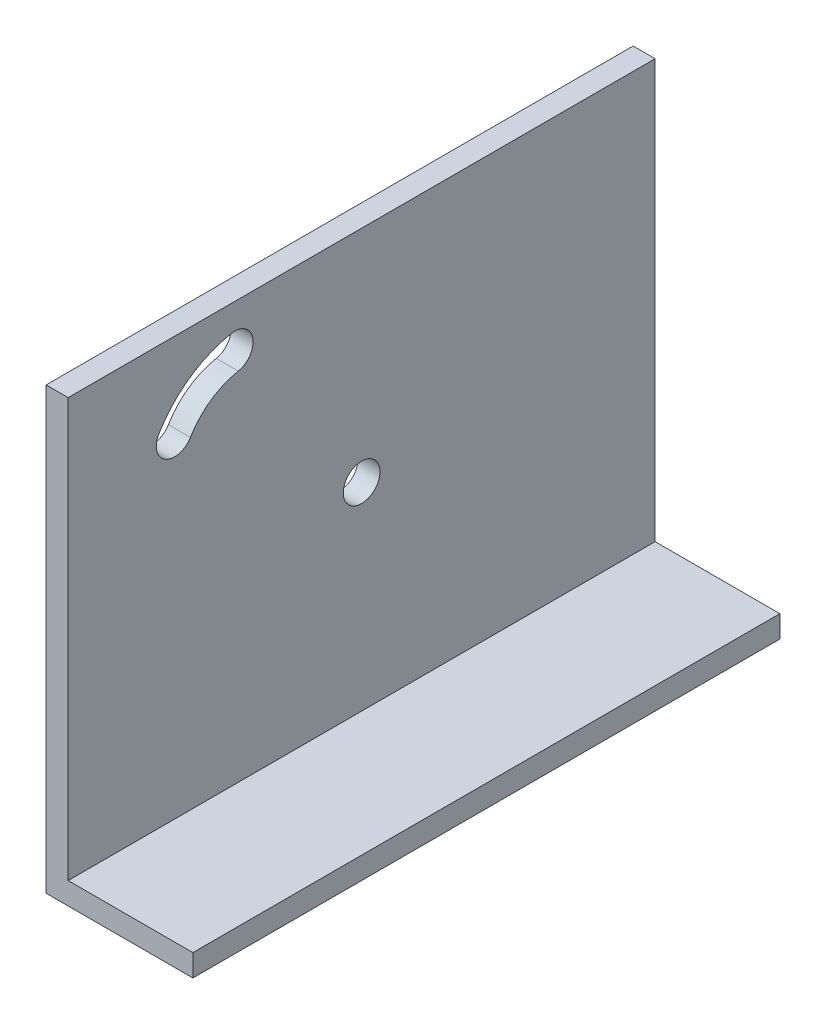
ISO-10303-21;
HEADER;
FILE_DESCRIPTION(('STEP AP214'),'2;1');
FILE_NAME('part.step','',(''),(''),'','','');
FILE_SCHEMA(('AUTOMOTIVE_DESIGN { 1 0 10303 214 1 1 1 1 }'));
ENDSEC;
DATA;
#1=APPLICATION_CONTEXT('core data for automotive mechanical design processes');
#2=APPLICATION_PROTOCOL_DEFINITION('international standard','automotive_design',2000,#1);
#3=PRODUCT_CONTEXT('',#1,'mechanical');
#4=PRODUCT('Part','Part','',(#3));
#5=PRODUCT_RELATED_PRODUCT_CATEGORY('part','',(#4));
#6=PRODUCT_DEFINITION_FORMATION('','',#4);
#7=PRODUCT_DEFINITION_CONTEXT('part definition',#1,'design');
#8=PRODUCT_DEFINITION('design','',#6,#7);
#9=PRODUCT_DEFINITION_SHAPE('','',#8);
#10=(LENGTH_UNIT() NAMED_UNIT(*) SI_UNIT(.MILLI.,.METRE.));
#11=(NAMED_UNIT(*) PLANE_ANGLE_UNIT() SI_UNIT($,.RADIAN.));
#12=(NAMED_UNIT(*) SI_UNIT($,.STERADIAN.) SOLID_ANGLE_UNIT());
#13=UNCERTAINTY_MEASURE_WITH_UNIT(LENGTH_MEASURE(1.E-05),#10,'distance_accuracy_value','');
#14=(GEOMETRIC_REPRESENTATION_CONTEXT(3) GLOBAL_UNCERTAINTY_ASSIGNED_CONTEXT((#13)) GLOBAL_UNIT_ASSIGNED_CONTEXT((#10,
#11,#12)) REPRESENTATION_CONTEXT('',''));
#15=CARTESIAN_POINT('',(0.,0.,0.));
#16=DIRECTION('',(0.,0.,1.));
#17=DIRECTION('',(1.,0.,0.));
#18=AXIS2_PLACEMENT_3D('',#15,#16,#17);
#19=CARTESIAN_POINT('',(0.,0.,80.));
#20=DIRECTION('',(1.,0.,0.));
#21=DIRECTION('',(0.,0.,-1.));
#22=AXIS2_PLACEMENT_3D('',#19,#20,#21);
#23=PLANE('',#22);
#24=CARTESIAN_POINT('',(0.,30.,40.));
#25=DIRECTION('',(-1.,0.,0.));
#26=DIRECTION('',(0.,0.,1.));
#27=AXIS2_PLACEMENT_3D('',#24,#25,#26);
#28=CIRCLE('',#27,2.5);
#29=CARTESIAN_POINT('',(0.,30.,42.5));
#30=VERTEX_POINT('',#29);
#31=EDGE_CURVE('E132',#30,#30,#28,.T.);
#32=ORIENTED_EDGE('',*,*,#31,.F.);
#33=EDGE_LOOP('',(#32));
#34=FACE_BOUND('',#33,.T.);
#35=DIRECTION('',(0.,-1.,0.));
#36=VECTOR('',#35,1.);
#37=CARTESIAN_POINT('',(0.,0.,0.));
#38=LINE('',#37,#36);
#39=CARTESIAN_POINT('',(0.,60.,0.));
#40=VERTEX_POINT('',#39);
#41=CARTESIAN_POINT('',(0.,0.,0.));
#42=VERTEX_POINT('',#41);
#43=EDGE_CURVE('E153',#40,#42,#38,.T.);
#44=ORIENTED_EDGE('',*,*,#43,.T.);
#45=DIRECTION('',(0.,0.,-1.));
#46=VECTOR('',#45,1.);
#47=CARTESIAN_POINT('',(0.,0.,80.));
#48=LINE('',#47,#46);
#49=CARTESIAN_POINT('',(0.,0.,80.));
#50=VERTEX_POINT('',#49);
#51=EDGE_CURVE('E179',#50,#42,#48,.T.);
#52=ORIENTED_EDGE('',*,*,#51,.F.);
#53=DIRECTION('',(0.,-1.,0.));
#54=VECTOR('',#53,1.);
#55=CARTESIAN_POINT('',(0.,0.,80.));
#56=LINE('',#55,#54);
#57=CARTESIAN_POINT('',(0.,60.,80.));
#58=VERTEX_POINT('',#57);
#59=EDGE_CURVE('E138',#58,#50,#56,.T.);
#60=ORIENTED_EDGE('',*,*,#59,.F.);
#61=DIRECTION('',(0.,0.,-1.));
#62=VECTOR('',#61,1.);
#63=CARTESIAN_POINT('',(0.,60.,80.));
#64=LINE('',#63,#62);
#65=EDGE_CURVE('E152',#58,#40,#64,.T.);
#66=ORIENTED_EDGE('',*,*,#65,.T.);
#67=EDGE_LOOP('',(#44,#52,#60,#66));
#68=FACE_BOUND('',#67,.T.);
#69=CARTESIAN_POINT('',(0.,42.,55.));
#70=DIRECTION('',(1.,0.,0.));
#71=DIRECTION('',(0.,0.,-1.));
#72=AXIS2_PLACEMENT_3D('',#69,#70,#71);
#73=CIRCLE('',#72,9.70655561573371);
#74=CARTESIAN_POINT('',(0.,51.5342666806233,56.8207088685695));
#75=VERTEX_POINT('',#74);
#76=CARTESIAN_POINT('',(0.,46.9741398812853,63.3351757247666));
#77=VERTEX_POINT('',#76);
#78=EDGE_CURVE('E120',#75,#77,#73,.T.);
#79=ORIENTED_EDGE('',*,*,#78,.F.);
#80=CARTESIAN_POINT('',(0.,53.9898923057341,57.289646806147));
#81=DIRECTION('',(-1.,0.,0.));
#82=DIRECTION('',(0.,0.,-1.));
#83=AXIS2_PLACEMENT_3D('',#80,#81,#82);
#84=CIRCLE('',#83,2.5);
#85=CARTESIAN_POINT('',(0.,56.4455179308448,57.7585847437245));
#86=VERTEX_POINT('',#85);
#87=EDGE_CURVE('E46',#86,#75,#84,.T.);
#88=ORIENTED_EDGE('',*,*,#87,.F.);
#89=CARTESIAN_POINT('',(0.,42.,55.));
#90=DIRECTION('',(-1.,0.,0.));
#91=DIRECTION('',(0.,0.,-1.));
#92=AXIS2_PLACEMENT_3D('',#89,#90,#91);
#93=CIRCLE('',#92,14.7065556157337);
#94=CARTESIAN_POINT('',(0.,49.5363978429162,67.6287562979082));
#95=VERTEX_POINT('',#94);
#96=EDGE_CURVE('E125',#95,#86,#93,.T.);
#97=ORIENTED_EDGE('',*,*,#96,.F.);
#98=CARTESIAN_POINT('',(0.,48.2552688621008,65.4819660113374));
#99=DIRECTION('',(-1.,0.,0.));
#100=DIRECTION('',(0.,0.,-1.));
#101=AXIS2_PLACEMENT_3D('',#98,#99,#100);
#102=CIRCLE('',#101,2.49999999999999);
#103=EDGE_CURVE('E111',#77,#95,#102,.T.);
#104=ORIENTED_EDGE('',*,*,#103,.F.);
#105=EDGE_LOOP('',(#79,#88,#97,#104));
#106=FACE_BOUND('',#105,.T.);
#107=ADVANCED_FACE('F32',(#34,#68,#106),#23,.F.);
#108=CARTESIAN_POINT('',(3.,60.,80.));
#109=DIRECTION('',(-1.,0.,0.));
#110=DIRECTION('',(0.,-1.,0.));
#111=AXIS2_PLACEMENT_3D('',#108,#109,#110);
#112=PLANE('',#111);
#113=CARTESIAN_POINT('',(3.,30.,40.));
#114=DIRECTION('',(-1.,0.,0.));
#115=DIRECTION('',(0.,-1.,0.));
#116=AXIS2_PLACEMENT_3D('',#113,#114,#115);
#117=CIRCLE('',#116,2.5);
#118=CARTESIAN_POINT('',(3.,27.5,40.));
#119=VERTEX_POINT('',#118);
#120=EDGE_CURVE('E137',#119,#119,#117,.T.);
#121=ORIENTED_EDGE('',*,*,#120,.T.);
#122=EDGE_LOOP('',(#121));
#123=FACE_BOUND('',#122,.T.);
#124=DIRECTION('',(0.,1.,0.));
#125=VECTOR('',#124,1.);
#126=CARTESIAN_POINT('',(3.,60.,0.));
#127=LINE('',#126,#125);
#128=CARTESIAN_POINT('',(3.00000000000001,3.,0.));
#129=VERTEX_POINT('',#128);
#130=CARTESIAN_POINT('',(3.,60.,0.));
#131=VERTEX_POINT('',#130);
#132=EDGE_CURVE('E162',#129,#131,#127,.T.);
#133=ORIENTED_EDGE('',*,*,#132,.T.);
#134=DIRECTION('',(0.,0.,-1.));
#135=VECTOR('',#134,1.);
#136=CARTESIAN_POINT('',(3.,60.,80.));
#137=LINE('',#136,#135);
#138=CARTESIAN_POINT('',(3.,60.,80.));
#139=VERTEX_POINT('',#138);
#140=EDGE_CURVE('E167',#139,#131,#137,.T.);
#141=ORIENTED_EDGE('',*,*,#140,.F.);
#142=DIRECTION('',(0.,1.,0.));
#143=VECTOR('',#142,1.);
#144=CARTESIAN_POINT('',(3.,60.,80.));
#145=LINE('',#144,#143);
#146=CARTESIAN_POINT('',(3.00000000000001,3.,80.));
#147=VERTEX_POINT('',#146);
#148=EDGE_CURVE('E148',#147,#139,#145,.T.);
#149=ORIENTED_EDGE('',*,*,#148,.F.);
#150=DIRECTION('',(0.,0.,-1.));
#151=VECTOR('',#150,1.);
#152=CARTESIAN_POINT('',(3.00000000000001,3.,80.));
#153=LINE('',#152,#151);
#154=EDGE_CURVE('E170',#147,#129,#153,.T.);
#155=ORIENTED_EDGE('',*,*,#154,.T.);
#156=EDGE_LOOP('',(#133,#141,#149,#155));
#157=FACE_BOUND('',#156,.T.);
#158=CARTESIAN_POINT('',(3.,42.,55.));
#159=DIRECTION('',(-1.,0.,0.));
#160=DIRECTION('',(0.,-1.,0.));
#161=AXIS2_PLACEMENT_3D('',#158,#159,#160);
#162=CIRCLE('',#161,14.7065556157337);
#163=CARTESIAN_POINT('',(3.,49.5363978429162,67.6287562979082));
#164=VERTEX_POINT('',#163);
#165=CARTESIAN_POINT('',(3.,56.4455179308448,57.7585847437245));
#166=VERTEX_POINT('',#165);
#167=EDGE_CURVE('E39',#164,#166,#162,.T.);
#168=ORIENTED_EDGE('',*,*,#167,.T.);
#169=CARTESIAN_POINT('',(3.,53.9898923057341,57.289646806147));
#170=DIRECTION('',(-1.,0.,0.));
#171=DIRECTION('',(0.,-1.,0.));
#172=AXIS2_PLACEMENT_3D('',#169,#170,#171);
#173=CIRCLE('',#172,2.5);
#174=CARTESIAN_POINT('',(3.,51.5342666806233,56.8207088685695));
#175=VERTEX_POINT('',#174);
#176=EDGE_CURVE('E11',#166,#175,#173,.T.);
#177=ORIENTED_EDGE('',*,*,#176,.T.);
#178=CARTESIAN_POINT('',(3.,42.,55.));
#179=DIRECTION('',(-1.,0.,0.));
#180=DIRECTION('',(0.,-1.,0.));
#181=AXIS2_PLACEMENT_3D('',#178,#179,#180);
#182=CIRCLE('',#181,9.70655561573371);
#183=CARTESIAN_POINT('',(3.,46.9741398812853,63.3351757247666));
#184=VERTEX_POINT('',#183);
#185=EDGE_CURVE('E182',#175,#184,#182,.F.);
#186=ORIENTED_EDGE('',*,*,#185,.T.);
#187=CARTESIAN_POINT('',(3.,48.2552688621008,65.4819660113374));
#188=DIRECTION('',(-1.,0.,0.));
#189=DIRECTION('',(0.,-1.,0.));
#190=AXIS2_PLACEMENT_3D('',#187,#188,#189);
#191=CIRCLE('',#190,2.49999999999999);
#192=EDGE_CURVE('E114',#184,#164,#191,.T.);
#193=ORIENTED_EDGE('',*,*,#192,.T.);
#194=EDGE_LOOP('',(#168,#177,#186,#193));
#195=FACE_BOUND('',#194,.T.);
#196=ADVANCED_FACE('F188',(#123,#157,#195),#112,.F.);
#197=CARTESIAN_POINT('',(0.,0.,80.));
#198=DIRECTION('',(0.,1.,0.));
#199=DIRECTION('',(0.,0.,1.));
#200=AXIS2_PLACEMENT_3D('',#197,#198,#199);
#201=PLANE('',#200);
#202=DIRECTION('',(1.,0.,0.));
#203=VECTOR('',#202,1.);
#204=CARTESIAN_POINT('',(0.,0.,0.));
#205=LINE('',#204,#203);
#206=CARTESIAN_POINT('',(20.,0.,0.));
#207=VERTEX_POINT('',#206);
#208=EDGE_CURVE('E156',#42,#207,#205,.T.);
#209=ORIENTED_EDGE('',*,*,#208,.T.);
#210=DIRECTION('',(0.,0.,-1.));
#211=VECTOR('',#210,1.);
#212=CARTESIAN_POINT('',(20.,0.,80.));
#213=LINE('',#212,#211);
#214=CARTESIAN_POINT('',(20.,0.,80.));
#215=VERTEX_POINT('',#214);
#216=EDGE_CURVE('E176',#215,#207,#213,.T.);
#217=ORIENTED_EDGE('',*,*,#216,.F.);
#218=DIRECTION('',(1.,0.,0.));
#219=VECTOR('',#218,1.);
#220=CARTESIAN_POINT('',(0.,0.,80.));
#221=LINE('',#220,#219);
#222=EDGE_CURVE('E141',#50,#215,#221,.T.);
#223=ORIENTED_EDGE('',*,*,#222,.F.);
#224=ORIENTED_EDGE('',*,*,#51,.T.);
#225=EDGE_LOOP('',(#209,#217,#223,#224));
#226=FACE_BOUND('',#225,.T.);
#227=ADVANCED_FACE('F210',(#226),#201,.F.);
#228=CARTESIAN_POINT('',(20.,0.,80.));
#229=DIRECTION('',(-1.,0.,0.));
#230=DIRECTION('',(0.,-1.,0.));
#231=AXIS2_PLACEMENT_3D('',#228,#229,#230);
#232=PLANE('',#231);
#233=DIRECTION('',(0.,1.,0.));
#234=VECTOR('',#233,1.);
#235=CARTESIAN_POINT('',(20.,0.,0.));
#236=LINE('',#235,#234);
#237=CARTESIAN_POINT('',(20.,3.,0.));
#238=VERTEX_POINT('',#237);
#239=EDGE_CURVE('E158',#207,#238,#236,.T.);
#240=ORIENTED_EDGE('',*,*,#239,.T.);
#241=DIRECTION('',(0.,0.,-1.));
#242=VECTOR('',#241,1.);
#243=CARTESIAN_POINT('',(20.,3.,80.));
#244=LINE('',#243,#242);
#245=CARTESIAN_POINT('',(20.,3.,80.));
#246=VERTEX_POINT('',#245);
#247=EDGE_CURVE('E173',#246,#238,#244,.T.);
#248=ORIENTED_EDGE('',*,*,#247,.F.);
#249=DIRECTION('',(0.,1.,0.));
#250=VECTOR('',#249,1.);
#251=CARTESIAN_POINT('',(20.,0.,80.));
#252=LINE('',#251,#250);
#253=EDGE_CURVE('E144',#215,#246,#252,.T.);
#254=ORIENTED_EDGE('',*,*,#253,.F.);
#255=ORIENTED_EDGE('',*,*,#216,.T.);
#256=EDGE_LOOP('',(#240,#248,#254,#255));
#257=FACE_BOUND('',#256,.T.);
#258=ADVANCED_FACE('F241',(#257),#232,.F.);
#259=CARTESIAN_POINT('',(20.,3.,80.));
#260=DIRECTION('',(0.,-1.,0.));
#261=DIRECTION('',(1.,0.,0.));
#262=AXIS2_PLACEMENT_3D('',#259,#260,#261);
#263=PLANE('',#262);
#264=DIRECTION('',(-1.,0.,0.));
#265=VECTOR('',#264,1.);
#266=CARTESIAN_POINT('',(20.,3.,0.));
#267=LINE('',#266,#265);
#268=EDGE_CURVE('E160',#238,#129,#267,.T.);
#269=ORIENTED_EDGE('',*,*,#268,.T.);
#270=ORIENTED_EDGE('',*,*,#154,.F.);
#271=DIRECTION('',(-1.,0.,0.));
#272=VECTOR('',#271,1.);
#273=CARTESIAN_POINT('',(20.,3.,80.));
#274=LINE('',#273,#272);
#275=EDGE_CURVE('E146',#246,#147,#274,.T.);
#276=ORIENTED_EDGE('',*,*,#275,.F.);
#277=ORIENTED_EDGE('',*,*,#247,.T.);
#278=EDGE_LOOP('',(#269,#270,#276,#277));
#279=FACE_BOUND('',#278,.T.);
#280=ADVANCED_FACE('F237',(#279),#263,.F.);
#281=CARTESIAN_POINT('',(0.,60.,80.));
#282=DIRECTION('',(0.,-1.,0.));
#283=DIRECTION('',(0.,0.,-1.));
#284=AXIS2_PLACEMENT_3D('',#281,#282,#283);
#285=PLANE('',#284);
#286=DIRECTION('',(-1.,0.,0.));
#287=VECTOR('',#286,1.);
#288=CARTESIAN_POINT('',(0.,60.,0.));
#289=LINE('',#288,#287);
#290=EDGE_CURVE('E142',#131,#40,#289,.T.);
#291=ORIENTED_EDGE('',*,*,#290,.T.);
#292=ORIENTED_EDGE('',*,*,#65,.F.);
#293=DIRECTION('',(-1.,0.,0.));
#294=VECTOR('',#293,1.);
#295=CARTESIAN_POINT('',(0.,60.,80.));
#296=LINE('',#295,#294);
#297=EDGE_CURVE('E150',#139,#58,#296,.T.);
#298=ORIENTED_EDGE('',*,*,#297,.F.);
#299=ORIENTED_EDGE('',*,*,#140,.T.);
#300=EDGE_LOOP('',(#291,#292,#298,#299));
#301=FACE_BOUND('',#300,.T.);
#302=ADVANCED_FACE('F233',(#301),#285,.F.);
#303=CARTESIAN_POINT('',(0.,0.,80.));
#304=DIRECTION('',(0.,0.,-1.));
#305=DIRECTION('',(-1.,0.,0.));
#306=AXIS2_PLACEMENT_3D('',#303,#304,#305);
#307=PLANE('',#306);
#308=ORIENTED_EDGE('',*,*,#59,.T.);
#309=ORIENTED_EDGE('',*,*,#222,.T.);
#310=ORIENTED_EDGE('',*,*,#253,.T.);
#311=ORIENTED_EDGE('',*,*,#275,.T.);
#312=ORIENTED_EDGE('',*,*,#148,.T.);
#313=ORIENTED_EDGE('',*,*,#297,.T.);
#314=EDGE_LOOP('',(#308,#309,#310,#311,#312,#313));
#315=FACE_BOUND('',#314,.T.);
#316=ADVANCED_FACE('F228',(#315),#307,.F.);
#317=CARTESIAN_POINT('',(0.,0.,0.));
#318=DIRECTION('',(0.,0.,-1.));
#319=DIRECTION('',(-1.,0.,0.));
#320=AXIS2_PLACEMENT_3D('',#317,#318,#319);
#321=PLANE('',#320);
#322=ORIENTED_EDGE('',*,*,#43,.F.);
#323=ORIENTED_EDGE('',*,*,#290,.F.);
#324=ORIENTED_EDGE('',*,*,#132,.F.);
#325=ORIENTED_EDGE('',*,*,#268,.F.);
#326=ORIENTED_EDGE('',*,*,#239,.F.);
#327=ORIENTED_EDGE('',*,*,#208,.F.);
#328=EDGE_LOOP('',(#322,#323,#324,#325,#326,#327));
#329=FACE_BOUND('',#328,.T.);
#330=ADVANCED_FACE('F201',(#329),#321,.T.);
#331=CARTESIAN_POINT('',(20.,30.,40.));
#332=DIRECTION('',(-1.,0.,0.));
#333=DIRECTION('',(0.,0.,1.));
#334=AXIS2_PLACEMENT_3D('',#331,#332,#333);
#335=CYLINDRICAL_SURFACE('',#334,2.5);
#336=ORIENTED_EDGE('',*,*,#31,.T.);
#337=EDGE_LOOP('',(#336));
#338=FACE_BOUND('',#337,.T.);
#339=ORIENTED_EDGE('',*,*,#120,.F.);
#340=EDGE_LOOP('',(#339));
#341=FACE_BOUND('',#340,.T.);
#342=ADVANCED_FACE('F194',(#338,#341),#335,.F.);
#343=CARTESIAN_POINT('',(10.,53.9898923057341,57.289646806147));
#344=DIRECTION('',(-1.,0.,0.));
#345=DIRECTION('',(0.,0.,1.));
#346=AXIS2_PLACEMENT_3D('',#343,#344,#345);
#347=CYLINDRICAL_SURFACE('',#346,2.5);
#348=DIRECTION('',(-1.,0.,0.));
#349=VECTOR('',#348,1.);
#350=CARTESIAN_POINT('',(10.,56.4455179308448,57.7585847437245));
#351=LINE('',#350,#349);
#352=EDGE_CURVE('E130',#166,#86,#351,.T.);
#353=ORIENTED_EDGE('',*,*,#352,.T.);
#354=ORIENTED_EDGE('',*,*,#87,.T.);
#355=DIRECTION('',(-1.,0.,0.));
#356=VECTOR('',#355,1.);
#357=CARTESIAN_POINT('',(10.,51.5342666806233,56.8207088685695));
#358=LINE('',#357,#356);
#359=EDGE_CURVE('E117',#175,#75,#358,.T.);
#360=ORIENTED_EDGE('',*,*,#359,.F.);
#361=ORIENTED_EDGE('',*,*,#176,.F.);
#362=EDGE_LOOP('',(#353,#354,#360,#361));
#363=FACE_BOUND('',#362,.T.);
#364=ADVANCED_FACE('F192',(#363),#347,.F.);
#365=CARTESIAN_POINT('',(10.,42.,55.));
#366=DIRECTION('',(-1.,0.,0.));
#367=DIRECTION('',(0.,0.,1.));
#368=AXIS2_PLACEMENT_3D('',#365,#366,#367);
#369=CYLINDRICAL_SURFACE('',#368,14.7065556157337);
#370=DIRECTION('',(-1.,0.,0.));
#371=VECTOR('',#370,1.);
#372=CARTESIAN_POINT('',(10.,49.5363978429162,67.6287562979082));
#373=LINE('',#372,#371);
#374=EDGE_CURVE('E116',#164,#95,#373,.T.);
#375=ORIENTED_EDGE('',*,*,#374,.T.);
#376=ORIENTED_EDGE('',*,*,#96,.T.);
#377=ORIENTED_EDGE('',*,*,#352,.F.);
#378=ORIENTED_EDGE('',*,*,#167,.F.);
#379=EDGE_LOOP('',(#375,#376,#377,#378));
#380=FACE_BOUND('',#379,.T.);
#381=ADVANCED_FACE('F191',(#380),#369,.F.);
#382=CARTESIAN_POINT('',(10.,48.2552688621008,65.4819660113374));
#383=DIRECTION('',(-1.,0.,0.));
#384=DIRECTION('',(0.,0.,1.));
#385=AXIS2_PLACEMENT_3D('',#382,#383,#384);
#386=CYLINDRICAL_SURFACE('',#385,2.49999999999999);
#387=DIRECTION('',(-1.,0.,0.));
#388=VECTOR('',#387,1.);
#389=CARTESIAN_POINT('',(10.,46.9741398812853,63.3351757247666));
#390=LINE('',#389,#388);
#391=EDGE_CURVE('E54',#184,#77,#390,.T.);
#392=ORIENTED_EDGE('',*,*,#391,.T.);
#393=ORIENTED_EDGE('',*,*,#103,.T.);
#394=ORIENTED_EDGE('',*,*,#374,.F.);
#395=ORIENTED_EDGE('',*,*,#192,.F.);
#396=EDGE_LOOP('',(#392,#393,#394,#395));
#397=FACE_BOUND('',#396,.T.);
#398=ADVANCED_FACE('F108',(#397),#386,.F.);
#399=CARTESIAN_POINT('',(10.,42.,55.));
#400=DIRECTION('',(-1.,0.,0.));
#401=DIRECTION('',(0.,0.,1.));
#402=AXIS2_PLACEMENT_3D('',#399,#400,#401);
#403=CYLINDRICAL_SURFACE('',#402,9.70655561573371);
#404=ORIENTED_EDGE('',*,*,#359,.T.);
#405=ORIENTED_EDGE('',*,*,#78,.T.);
#406=ORIENTED_EDGE('',*,*,#391,.F.);
#407=ORIENTED_EDGE('',*,*,#185,.F.);
#408=EDGE_LOOP('',(#404,#405,#406,#407));
#409=FACE_BOUND('',#408,.T.);
#410=ADVANCED_FACE('F121',(#409),#403,.T.);
#411=CLOSED_SHELL('',(#107,#196,#227,#258,#280,#302,#316,#330,#342,#364,#381,#398,#410));
#412=MANIFOLD_SOLID_BREP('B2',#411);
#413=ADVANCED_BREP_SHAPE_REPRESENTATION('',(#18,#412),#14);
#414=SHAPE_DEFINITION_REPRESENTATION(#9,#413);
ENDSEC;
END-ISO-10303-21;
